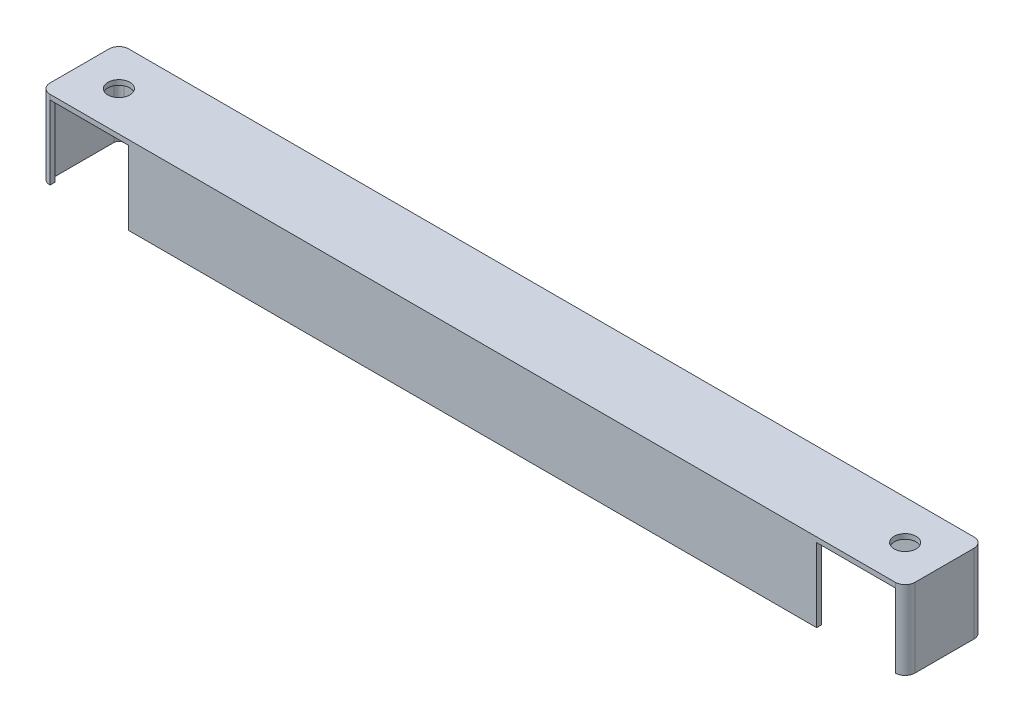
ISO-10303-21;
HEADER;
FILE_DESCRIPTION(('STEP AP214'),'2;1');
FILE_NAME('part.step','',(''),(''),'','','');
FILE_SCHEMA(('AUTOMOTIVE_DESIGN { 1 0 10303 214 1 1 1 1 }'));
ENDSEC;
DATA;
#1=APPLICATION_CONTEXT('core data for automotive mechanical design processes');
#2=APPLICATION_PROTOCOL_DEFINITION('international standard','automotive_design',2000,#1);
#3=PRODUCT_CONTEXT('',#1,'mechanical');
#4=PRODUCT('Part','Part','',(#3));
#5=PRODUCT_RELATED_PRODUCT_CATEGORY('part','',(#4));
#6=PRODUCT_DEFINITION_FORMATION('','',#4);
#7=PRODUCT_DEFINITION_CONTEXT('part definition',#1,'design');
#8=PRODUCT_DEFINITION('design','',#6,#7);
#9=PRODUCT_DEFINITION_SHAPE('','',#8);
#10=(LENGTH_UNIT() NAMED_UNIT(*) SI_UNIT(.MILLI.,.METRE.));
#11=(NAMED_UNIT(*) PLANE_ANGLE_UNIT() SI_UNIT($,.RADIAN.));
#12=(NAMED_UNIT(*) SI_UNIT($,.STERADIAN.) SOLID_ANGLE_UNIT());
#13=UNCERTAINTY_MEASURE_WITH_UNIT(LENGTH_MEASURE(1.E-05),#10,'distance_accuracy_value','');
#14=(GEOMETRIC_REPRESENTATION_CONTEXT(3) GLOBAL_UNCERTAINTY_ASSIGNED_CONTEXT((#13)) GLOBAL_UNIT_ASSIGNED_CONTEXT((#10,
#11,#12)) REPRESENTATION_CONTEXT('',''));
#15=CARTESIAN_POINT('',(0.,0.,0.));
#16=DIRECTION('',(0.,0.,1.));
#17=DIRECTION('',(1.,0.,0.));
#18=AXIS2_PLACEMENT_3D('',#15,#16,#17);
#19=CARTESIAN_POINT('',(136.525,0.,-9.525));
#20=DIRECTION('',(0.,-1.,0.));
#21=DIRECTION('',(0.,0.,-1.));
#22=AXIS2_PLACEMENT_3D('',#19,#20,#21);
#23=PLANE('',#22);
#24=DIRECTION('',(0.,0.,1.));
#25=VECTOR('',#24,1.);
#26=CARTESIAN_POINT('',(-111.125,0.,12.7));
#27=LINE('',#26,#25);
#28=CARTESIAN_POINT('',(-111.125,0.,11.1125));
#29=VERTEX_POINT('',#28);
#30=CARTESIAN_POINT('',(-111.125,0.,12.7));
#31=VERTEX_POINT('',#30);
#32=EDGE_CURVE('E338',#29,#31,#27,.T.);
#33=ORIENTED_EDGE('',*,*,#32,.F.);
#34=DIRECTION('',(-1.,0.,0.));
#35=VECTOR('',#34,1.);
#36=CARTESIAN_POINT('',(111.125,0.,11.1125));
#37=LINE('',#36,#35);
#38=CARTESIAN_POINT('',(111.125,0.,11.1125));
#39=VERTEX_POINT('',#38);
#40=EDGE_CURVE('E294',#39,#29,#37,.T.);
#41=ORIENTED_EDGE('',*,*,#40,.F.);
#42=DIRECTION('',(0.,0.,-1.));
#43=VECTOR('',#42,1.);
#44=CARTESIAN_POINT('',(111.125,0.,12.7));
#45=LINE('',#44,#43);
#46=CARTESIAN_POINT('',(111.125,0.,12.7));
#47=VERTEX_POINT('',#46);
#48=EDGE_CURVE('E299',#47,#39,#45,.T.);
#49=ORIENTED_EDGE('',*,*,#48,.F.);
#50=DIRECTION('',(1.,0.,0.));
#51=VECTOR('',#50,1.);
#52=CARTESIAN_POINT('',(-136.525,0.,12.7));
#53=LINE('',#52,#51);
#54=EDGE_CURVE('E171',#31,#47,#53,.T.);
#55=ORIENTED_EDGE('',*,*,#54,.F.);
#56=EDGE_LOOP('',(#33,#41,#49,#55));
#57=FACE_BOUND('',#56,.T.);
#58=ADVANCED_FACE('F43',(#57),#23,.T.);
#59=CARTESIAN_POINT('',(127.,25.4,0.));
#60=DIRECTION('',(0.,-1.,0.));
#61=DIRECTION('',(0.,0.,-1.));
#62=AXIS2_PLACEMENT_3D('',#59,#60,#61);
#63=CYLINDRICAL_SURFACE('',#62,3.55600000000001);
#64=CARTESIAN_POINT('',(127.,25.4,0.));
#65=DIRECTION('',(0.,1.,0.));
#66=DIRECTION('',(0.,0.,1.));
#67=AXIS2_PLACEMENT_3D('',#64,#65,#66);
#68=CIRCLE('',#67,3.55600000000001);
#69=CARTESIAN_POINT('',(127.,25.4,3.556));
#70=VERTEX_POINT('',#69);
#71=EDGE_CURVE('E158',#70,#70,#68,.T.);
#72=ORIENTED_EDGE('',*,*,#71,.T.);
#73=EDGE_LOOP('',(#72));
#74=FACE_BOUND('',#73,.T.);
#75=CARTESIAN_POINT('',(127.,23.8125,0.));
#76=DIRECTION('',(0.,-1.,0.));
#77=DIRECTION('',(0.,0.,-1.));
#78=AXIS2_PLACEMENT_3D('',#75,#76,#77);
#79=CIRCLE('',#78,3.55600000000001);
#80=CARTESIAN_POINT('',(127.,23.8125,-3.55600000000002));
#81=VERTEX_POINT('',#80);
#82=EDGE_CURVE('E234',#81,#81,#79,.T.);
#83=ORIENTED_EDGE('',*,*,#82,.T.);
#84=EDGE_LOOP('',(#83));
#85=FACE_BOUND('',#84,.T.);
#86=ADVANCED_FACE('F491',(#74,#85),#63,.F.);
#87=CARTESIAN_POINT('',(-127.,25.4,0.));
#88=DIRECTION('',(0.,-1.,0.));
#89=DIRECTION('',(0.,0.,-1.));
#90=AXIS2_PLACEMENT_3D('',#87,#88,#89);
#91=CYLINDRICAL_SURFACE('',#90,3.556);
#92=CARTESIAN_POINT('',(-127.,25.4,0.));
#93=DIRECTION('',(0.,1.,0.));
#94=DIRECTION('',(0.,0.,1.));
#95=AXIS2_PLACEMENT_3D('',#92,#93,#94);
#96=CIRCLE('',#95,3.556);
#97=CARTESIAN_POINT('',(-127.,25.4,3.55600000000001));
#98=VERTEX_POINT('',#97);
#99=EDGE_CURVE('E230',#98,#98,#96,.T.);
#100=ORIENTED_EDGE('',*,*,#99,.T.);
#101=EDGE_LOOP('',(#100));
#102=FACE_BOUND('',#101,.T.);
#103=CARTESIAN_POINT('',(-127.,23.8125,0.));
#104=DIRECTION('',(0.,-1.,0.));
#105=DIRECTION('',(0.,0.,-1.));
#106=AXIS2_PLACEMENT_3D('',#103,#104,#105);
#107=CIRCLE('',#106,3.556);
#108=CARTESIAN_POINT('',(-127.,23.8125,-3.55599999999999));
#109=VERTEX_POINT('',#108);
#110=EDGE_CURVE('E47',#109,#109,#107,.T.);
#111=ORIENTED_EDGE('',*,*,#110,.T.);
#112=EDGE_LOOP('',(#111));
#113=FACE_BOUND('',#112,.T.);
#114=ADVANCED_FACE('F495',(#102,#113),#91,.F.);
#115=CARTESIAN_POINT('',(136.525,25.4,-9.525));
#116=DIRECTION('',(0.,-1.,0.));
#117=DIRECTION('',(0.,0.,-1.));
#118=AXIS2_PLACEMENT_3D('',#115,#116,#117);
#119=PLANE('',#118);
#120=CARTESIAN_POINT('',(136.525,25.4,-9.525));
#121=DIRECTION('',(0.,1.,0.));
#122=DIRECTION('',(0.,0.,-1.));
#123=AXIS2_PLACEMENT_3D('',#120,#121,#122);
#124=CIRCLE('',#123,3.17500000000002);
#125=CARTESIAN_POINT('',(139.7,25.4,-9.525));
#126=VERTEX_POINT('',#125);
#127=CARTESIAN_POINT('',(136.525,25.4,-12.7));
#128=VERTEX_POINT('',#127);
#129=EDGE_CURVE('E178',#126,#128,#124,.T.);
#130=ORIENTED_EDGE('',*,*,#129,.T.);
#131=DIRECTION('',(-1.,0.,0.));
#132=VECTOR('',#131,1.);
#133=CARTESIAN_POINT('',(-136.525,25.4,-12.7));
#134=LINE('',#133,#132);
#135=CARTESIAN_POINT('',(-136.525,25.4,-12.7));
#136=VERTEX_POINT('',#135);
#137=EDGE_CURVE('E103',#128,#136,#134,.T.);
#138=ORIENTED_EDGE('',*,*,#137,.T.);
#139=CARTESIAN_POINT('',(-136.525,25.4,-9.525));
#140=DIRECTION('',(0.,1.,0.));
#141=DIRECTION('',(0.,0.,-1.));
#142=AXIS2_PLACEMENT_3D('',#139,#140,#141);
#143=CIRCLE('',#142,3.17500000000001);
#144=CARTESIAN_POINT('',(-139.7,25.4,-9.525));
#145=VERTEX_POINT('',#144);
#146=EDGE_CURVE('E200',#136,#145,#143,.T.);
#147=ORIENTED_EDGE('',*,*,#146,.T.);
#148=DIRECTION('',(0.,0.,1.));
#149=VECTOR('',#148,1.);
#150=CARTESIAN_POINT('',(-139.7,25.4,9.525));
#151=LINE('',#150,#149);
#152=CARTESIAN_POINT('',(-139.7,25.4,9.525));
#153=VERTEX_POINT('',#152);
#154=EDGE_CURVE('E217',#145,#153,#151,.T.);
#155=ORIENTED_EDGE('',*,*,#154,.T.);
#156=CARTESIAN_POINT('',(-136.525,25.4,9.525));
#157=DIRECTION('',(0.,1.,0.));
#158=DIRECTION('',(0.,0.,-1.));
#159=AXIS2_PLACEMENT_3D('',#156,#157,#158);
#160=CIRCLE('',#159,3.17500000000001);
#161=CARTESIAN_POINT('',(-136.525,25.4,12.7));
#162=VERTEX_POINT('',#161);
#163=EDGE_CURVE('E126',#153,#162,#160,.T.);
#164=ORIENTED_EDGE('',*,*,#163,.T.);
#165=DIRECTION('',(1.,0.,0.));
#166=VECTOR('',#165,1.);
#167=CARTESIAN_POINT('',(-136.525,25.4,12.7));
#168=LINE('',#167,#166);
#169=CARTESIAN_POINT('',(136.525,25.4,12.7));
#170=VERTEX_POINT('',#169);
#171=EDGE_CURVE('E119',#162,#170,#168,.T.);
#172=ORIENTED_EDGE('',*,*,#171,.T.);
#173=CARTESIAN_POINT('',(136.525,25.4,9.525));
#174=DIRECTION('',(0.,1.,0.));
#175=DIRECTION('',(0.,0.,1.));
#176=AXIS2_PLACEMENT_3D('',#173,#174,#175);
#177=CIRCLE('',#176,3.17500000000002);
#178=CARTESIAN_POINT('',(139.7,25.4,9.525));
#179=VERTEX_POINT('',#178);
#180=EDGE_CURVE('E124',#170,#179,#177,.T.);
#181=ORIENTED_EDGE('',*,*,#180,.T.);
#182=DIRECTION('',(0.,0.,-1.));
#183=VECTOR('',#182,1.);
#184=CARTESIAN_POINT('',(139.7,25.4,9.525));
#185=LINE('',#184,#183);
#186=EDGE_CURVE('E62',#179,#126,#185,.T.);
#187=ORIENTED_EDGE('',*,*,#186,.T.);
#188=EDGE_LOOP('',(#130,#138,#147,#155,#164,#172,#181,#187));
#189=FACE_BOUND('',#188,.T.);
#190=ORIENTED_EDGE('',*,*,#71,.F.);
#191=EDGE_LOOP('',(#190));
#192=FACE_BOUND('',#191,.T.);
#193=ORIENTED_EDGE('',*,*,#99,.F.);
#194=EDGE_LOOP('',(#193));
#195=FACE_BOUND('',#194,.T.);
#196=ADVANCED_FACE('F121',(#189,#192,#195),#119,.F.);
#197=DIRECTION('',(0.,0.,1.));
#198=VECTOR('',#197,1.);
#199=CARTESIAN_POINT('',(136.525,0.,11.1125));
#200=LINE('',#199,#198);
#201=CARTESIAN_POINT('',(136.525,0.,11.1125));
#202=VERTEX_POINT('',#201);
#203=CARTESIAN_POINT('',(136.525,0.,12.7));
#204=VERTEX_POINT('',#203);
#205=EDGE_CURVE('E303',#202,#204,#200,.T.);
#206=ORIENTED_EDGE('',*,*,#205,.F.);
#207=CARTESIAN_POINT('',(136.525,0.,9.525));
#208=DIRECTION('',(0.,-1.,0.));
#209=DIRECTION('',(0.,0.,-1.));
#210=AXIS2_PLACEMENT_3D('',#207,#208,#209);
#211=CIRCLE('',#210,1.58750000000001);
#212=CARTESIAN_POINT('',(138.1125,0.,9.525));
#213=VERTEX_POINT('',#212);
#214=EDGE_CURVE('E306',#213,#202,#211,.T.);
#215=ORIENTED_EDGE('',*,*,#214,.F.);
#216=DIRECTION('',(0.,0.,1.));
#217=VECTOR('',#216,1.);
#218=CARTESIAN_POINT('',(138.1125,0.,-9.525));
#219=LINE('',#218,#217);
#220=CARTESIAN_POINT('',(138.1125,0.,-9.525));
#221=VERTEX_POINT('',#220);
#222=EDGE_CURVE('E310',#221,#213,#219,.T.);
#223=ORIENTED_EDGE('',*,*,#222,.F.);
#224=CARTESIAN_POINT('',(136.525,0.,-9.525));
#225=DIRECTION('',(0.,-1.,0.));
#226=DIRECTION('',(0.,0.,-1.));
#227=AXIS2_PLACEMENT_3D('',#224,#225,#226);
#228=CIRCLE('',#227,1.58750000000001);
#229=CARTESIAN_POINT('',(136.525,0.,-11.1125));
#230=VERTEX_POINT('',#229);
#231=EDGE_CURVE('E314',#230,#221,#228,.T.);
#232=ORIENTED_EDGE('',*,*,#231,.F.);
#233=DIRECTION('',(1.,0.,0.));
#234=VECTOR('',#233,1.);
#235=CARTESIAN_POINT('',(-136.525,0.,-11.1125));
#236=LINE('',#235,#234);
#237=CARTESIAN_POINT('',(-136.525,0.,-11.1125));
#238=VERTEX_POINT('',#237);
#239=EDGE_CURVE('E318',#238,#230,#236,.T.);
#240=ORIENTED_EDGE('',*,*,#239,.F.);
#241=CARTESIAN_POINT('',(-136.525,0.,-9.525));
#242=DIRECTION('',(0.,-1.,0.));
#243=DIRECTION('',(0.,0.,-1.));
#244=AXIS2_PLACEMENT_3D('',#241,#242,#243);
#245=CIRCLE('',#244,1.58750000000001);
#246=CARTESIAN_POINT('',(-138.1125,0.,-9.525));
#247=VERTEX_POINT('',#246);
#248=EDGE_CURVE('E322',#247,#238,#245,.T.);
#249=ORIENTED_EDGE('',*,*,#248,.F.);
#250=DIRECTION('',(0.,0.,-1.));
#251=VECTOR('',#250,1.);
#252=CARTESIAN_POINT('',(-138.1125,0.,9.525));
#253=LINE('',#252,#251);
#254=CARTESIAN_POINT('',(-138.1125,0.,9.525));
#255=VERTEX_POINT('',#254);
#256=EDGE_CURVE('E326',#255,#247,#253,.T.);
#257=ORIENTED_EDGE('',*,*,#256,.F.);
#258=CARTESIAN_POINT('',(-136.525,0.,9.525));
#259=DIRECTION('',(0.,-1.,0.));
#260=DIRECTION('',(0.,0.,-1.));
#261=AXIS2_PLACEMENT_3D('',#258,#259,#260);
#262=CIRCLE('',#261,1.58750000000001);
#263=CARTESIAN_POINT('',(-136.525,0.,11.1125));
#264=VERTEX_POINT('',#263);
#265=EDGE_CURVE('E330',#264,#255,#262,.T.);
#266=ORIENTED_EDGE('',*,*,#265,.F.);
#267=DIRECTION('',(0.,0.,-1.));
#268=VECTOR('',#267,1.);
#269=CARTESIAN_POINT('',(-136.525,0.,11.1125));
#270=LINE('',#269,#268);
#271=CARTESIAN_POINT('',(-136.525,0.,12.7));
#272=VERTEX_POINT('',#271);
#273=EDGE_CURVE('E334',#272,#264,#270,.T.);
#274=ORIENTED_EDGE('',*,*,#273,.F.);
#275=CARTESIAN_POINT('',(-136.525,0.,9.525));
#276=DIRECTION('',(0.,1.,0.));
#277=DIRECTION('',(0.,0.,-1.));
#278=AXIS2_PLACEMENT_3D('',#275,#276,#277);
#279=CIRCLE('',#278,3.17500000000001);
#280=CARTESIAN_POINT('',(-139.7,0.,9.525));
#281=VERTEX_POINT('',#280);
#282=EDGE_CURVE('E167',#281,#272,#279,.T.);
#283=ORIENTED_EDGE('',*,*,#282,.F.);
#284=DIRECTION('',(0.,0.,1.));
#285=VECTOR('',#284,1.);
#286=CARTESIAN_POINT('',(-139.7,0.,9.525));
#287=LINE('',#286,#285);
#288=CARTESIAN_POINT('',(-139.7,0.,-9.525));
#289=VERTEX_POINT('',#288);
#290=EDGE_CURVE('E164',#289,#281,#287,.T.);
#291=ORIENTED_EDGE('',*,*,#290,.F.);
#292=CARTESIAN_POINT('',(-136.525,0.,-9.525));
#293=DIRECTION('',(0.,1.,0.));
#294=DIRECTION('',(0.,0.,-1.));
#295=AXIS2_PLACEMENT_3D('',#292,#293,#294);
#296=CIRCLE('',#295,3.17500000000001);
#297=CARTESIAN_POINT('',(-136.525,0.,-12.7));
#298=VERTEX_POINT('',#297);
#299=EDGE_CURVE('E161',#298,#289,#296,.T.);
#300=ORIENTED_EDGE('',*,*,#299,.F.);
#301=DIRECTION('',(-1.,0.,0.));
#302=VECTOR('',#301,1.);
#303=CARTESIAN_POINT('',(-136.525,0.,-12.7));
#304=LINE('',#303,#302);
#305=CARTESIAN_POINT('',(136.525,0.,-12.7));
#306=VERTEX_POINT('',#305);
#307=EDGE_CURVE('E157',#306,#298,#304,.T.);
#308=ORIENTED_EDGE('',*,*,#307,.F.);
#309=CARTESIAN_POINT('',(136.525,0.,-9.525));
#310=DIRECTION('',(0.,1.,0.));
#311=DIRECTION('',(0.,0.,-1.));
#312=AXIS2_PLACEMENT_3D('',#309,#310,#311);
#313=CIRCLE('',#312,3.17500000000002);
#314=CARTESIAN_POINT('',(139.7,0.,-9.525));
#315=VERTEX_POINT('',#314);
#316=EDGE_CURVE('E153',#315,#306,#313,.T.);
#317=ORIENTED_EDGE('',*,*,#316,.F.);
#318=DIRECTION('',(0.,0.,-1.));
#319=VECTOR('',#318,1.);
#320=CARTESIAN_POINT('',(139.7,0.,9.525));
#321=LINE('',#320,#319);
#322=CARTESIAN_POINT('',(139.7,0.,9.525));
#323=VERTEX_POINT('',#322);
#324=EDGE_CURVE('E95',#323,#315,#321,.T.);
#325=ORIENTED_EDGE('',*,*,#324,.F.);
#326=CARTESIAN_POINT('',(136.525,0.,9.525));
#327=DIRECTION('',(0.,1.,0.));
#328=DIRECTION('',(0.,0.,1.));
#329=AXIS2_PLACEMENT_3D('',#326,#327,#328);
#330=CIRCLE('',#329,3.17500000000002);
#331=EDGE_CURVE('E89',#204,#323,#330,.T.);
#332=ORIENTED_EDGE('',*,*,#331,.F.);
#333=EDGE_LOOP('',(#206,#215,#223,#232,#240,#249,#257,#266,#274,#283,#291,#300,#308,#317,#325,#332));
#334=FACE_BOUND('',#333,.T.);
#335=ADVANCED_FACE('F204',(#334),#23,.T.);
#336=CARTESIAN_POINT('',(136.525,25.4,-9.525));
#337=DIRECTION('',(0.,-1.,0.));
#338=DIRECTION('',(0.,0.,-1.));
#339=AXIS2_PLACEMENT_3D('',#336,#337,#338);
#340=CYLINDRICAL_SURFACE('',#339,3.17500000000002);
#341=ORIENTED_EDGE('',*,*,#316,.T.);
#342=DIRECTION('',(0.,-1.,0.));
#343=VECTOR('',#342,1.);
#344=CARTESIAN_POINT('',(136.525,25.4,-12.7));
#345=LINE('',#344,#343);
#346=EDGE_CURVE('E11',#128,#306,#345,.T.);
#347=ORIENTED_EDGE('',*,*,#346,.F.);
#348=ORIENTED_EDGE('',*,*,#129,.F.);
#349=DIRECTION('',(0.,-1.,0.));
#350=VECTOR('',#349,1.);
#351=CARTESIAN_POINT('',(139.7,25.4,-9.525));
#352=LINE('',#351,#350);
#353=EDGE_CURVE('E149',#126,#315,#352,.T.);
#354=ORIENTED_EDGE('',*,*,#353,.T.);
#355=EDGE_LOOP('',(#341,#347,#348,#354));
#356=FACE_BOUND('',#355,.T.);
#357=ADVANCED_FACE('F45',(#356),#340,.T.);
#358=CARTESIAN_POINT('',(-136.525,25.4,-12.7));
#359=DIRECTION('',(0.,0.,1.));
#360=DIRECTION('',(1.,0.,0.));
#361=AXIS2_PLACEMENT_3D('',#358,#359,#360);
#362=PLANE('',#361);
#363=ORIENTED_EDGE('',*,*,#307,.T.);
#364=DIRECTION('',(0.,-1.,0.));
#365=VECTOR('',#364,1.);
#366=CARTESIAN_POINT('',(-136.525,25.4,-12.7));
#367=LINE('',#366,#365);
#368=EDGE_CURVE('E54',#136,#298,#367,.T.);
#369=ORIENTED_EDGE('',*,*,#368,.F.);
#370=ORIENTED_EDGE('',*,*,#137,.F.);
#371=ORIENTED_EDGE('',*,*,#346,.T.);
#372=EDGE_LOOP('',(#363,#369,#370,#371));
#373=FACE_BOUND('',#372,.T.);
#374=ADVANCED_FACE('F504',(#373),#362,.F.);
#375=CARTESIAN_POINT('',(-136.525,25.4,-9.525));
#376=DIRECTION('',(0.,-1.,0.));
#377=DIRECTION('',(0.,0.,-1.));
#378=AXIS2_PLACEMENT_3D('',#375,#376,#377);
#379=CYLINDRICAL_SURFACE('',#378,3.17500000000001);
#380=ORIENTED_EDGE('',*,*,#299,.T.);
#381=DIRECTION('',(0.,-1.,0.));
#382=VECTOR('',#381,1.);
#383=CARTESIAN_POINT('',(-139.7,25.4,-9.525));
#384=LINE('',#383,#382);
#385=EDGE_CURVE('E189',#145,#289,#384,.T.);
#386=ORIENTED_EDGE('',*,*,#385,.F.);
#387=ORIENTED_EDGE('',*,*,#146,.F.);
#388=ORIENTED_EDGE('',*,*,#368,.T.);
#389=EDGE_LOOP('',(#380,#386,#387,#388));
#390=FACE_BOUND('',#389,.T.);
#391=ADVANCED_FACE('F198',(#390),#379,.T.);
#392=CARTESIAN_POINT('',(-139.7,25.4,9.525));
#393=DIRECTION('',(1.,0.,0.));
#394=DIRECTION('',(0.,0.,-1.));
#395=AXIS2_PLACEMENT_3D('',#392,#393,#394);
#396=PLANE('',#395);
#397=ORIENTED_EDGE('',*,*,#290,.T.);
#398=DIRECTION('',(0.,-1.,0.));
#399=VECTOR('',#398,1.);
#400=CARTESIAN_POINT('',(-139.7,25.4,9.525));
#401=LINE('',#400,#399);
#402=EDGE_CURVE('E185',#153,#281,#401,.T.);
#403=ORIENTED_EDGE('',*,*,#402,.F.);
#404=ORIENTED_EDGE('',*,*,#154,.F.);
#405=ORIENTED_EDGE('',*,*,#385,.T.);
#406=EDGE_LOOP('',(#397,#403,#404,#405));
#407=FACE_BOUND('',#406,.T.);
#408=ADVANCED_FACE('F210',(#407),#396,.F.);
#409=CARTESIAN_POINT('',(-136.525,25.4,9.525));
#410=DIRECTION('',(0.,-1.,0.));
#411=DIRECTION('',(0.,0.,-1.));
#412=AXIS2_PLACEMENT_3D('',#409,#410,#411);
#413=CYLINDRICAL_SURFACE('',#412,3.17500000000001);
#414=ORIENTED_EDGE('',*,*,#282,.T.);
#415=DIRECTION('',(0.,-1.,0.));
#416=VECTOR('',#415,1.);
#417=CARTESIAN_POINT('',(-136.525,23.8125,12.7));
#418=LINE('',#417,#416);
#419=CARTESIAN_POINT('',(-136.525,23.8125,12.7));
#420=VERTEX_POINT('',#419);
#421=EDGE_CURVE('E242',#420,#272,#418,.T.);
#422=ORIENTED_EDGE('',*,*,#421,.F.);
#423=DIRECTION('',(0.,-1.,0.));
#424=VECTOR('',#423,1.);
#425=CARTESIAN_POINT('',(-136.525,25.4,12.7));
#426=LINE('',#425,#424);
#427=EDGE_CURVE('E142',#162,#420,#426,.T.);
#428=ORIENTED_EDGE('',*,*,#427,.F.);
#429=ORIENTED_EDGE('',*,*,#163,.F.);
#430=ORIENTED_EDGE('',*,*,#402,.T.);
#431=EDGE_LOOP('',(#414,#422,#428,#429,#430));
#432=FACE_BOUND('',#431,.T.);
#433=ADVANCED_FACE('F213',(#432),#413,.T.);
#434=CARTESIAN_POINT('',(-136.525,25.4,12.7));
#435=DIRECTION('',(0.,0.,-1.));
#436=DIRECTION('',(-1.,0.,0.));
#437=AXIS2_PLACEMENT_3D('',#434,#435,#436);
#438=PLANE('',#437);
#439=ORIENTED_EDGE('',*,*,#54,.T.);
#440=DIRECTION('',(0.,-1.,0.));
#441=VECTOR('',#440,1.);
#442=CARTESIAN_POINT('',(111.125,23.8125,12.7));
#443=LINE('',#442,#441);
#444=CARTESIAN_POINT('',(111.125,23.8125,12.7));
#445=VERTEX_POINT('',#444);
#446=EDGE_CURVE('E282',#445,#47,#443,.T.);
#447=ORIENTED_EDGE('',*,*,#446,.F.);
#448=DIRECTION('',(-1.,0.,0.));
#449=VECTOR('',#448,1.);
#450=CARTESIAN_POINT('',(136.525,23.8125,12.7));
#451=LINE('',#450,#449);
#452=CARTESIAN_POINT('',(136.525,23.8125,12.7));
#453=VERTEX_POINT('',#452);
#454=EDGE_CURVE('E140',#453,#445,#451,.T.);
#455=ORIENTED_EDGE('',*,*,#454,.F.);
#456=DIRECTION('',(0.,-1.,0.));
#457=VECTOR('',#456,1.);
#458=CARTESIAN_POINT('',(136.525,25.4,12.7));
#459=LINE('',#458,#457);
#460=EDGE_CURVE('E134',#170,#453,#459,.T.);
#461=ORIENTED_EDGE('',*,*,#460,.F.);
#462=ORIENTED_EDGE('',*,*,#171,.F.);
#463=ORIENTED_EDGE('',*,*,#427,.T.);
#464=DIRECTION('',(-1.,0.,0.));
#465=VECTOR('',#464,1.);
#466=CARTESIAN_POINT('',(-136.525,23.8125,12.7));
#467=LINE('',#466,#465);
#468=CARTESIAN_POINT('',(-111.125,23.8125,12.7));
#469=VERTEX_POINT('',#468);
#470=EDGE_CURVE('E387',#469,#420,#467,.T.);
#471=ORIENTED_EDGE('',*,*,#470,.F.);
#472=DIRECTION('',(0.,-1.,0.));
#473=VECTOR('',#472,1.);
#474=CARTESIAN_POINT('',(-111.125,23.8125,12.7));
#475=LINE('',#474,#473);
#476=EDGE_CURVE('E238',#469,#31,#475,.T.);
#477=ORIENTED_EDGE('',*,*,#476,.T.);
#478=EDGE_LOOP('',(#439,#447,#455,#461,#462,#463,#471,#477));
#479=FACE_BOUND('',#478,.T.);
#480=ADVANCED_FACE('F136',(#479),#438,.F.);
#481=CARTESIAN_POINT('',(136.525,25.4,9.525));
#482=DIRECTION('',(0.,-1.,0.));
#483=DIRECTION('',(0.,0.,-1.));
#484=AXIS2_PLACEMENT_3D('',#481,#482,#483);
#485=CYLINDRICAL_SURFACE('',#484,3.17500000000002);
#486=ORIENTED_EDGE('',*,*,#331,.T.);
#487=DIRECTION('',(0.,-1.,0.));
#488=VECTOR('',#487,1.);
#489=CARTESIAN_POINT('',(139.7,25.4,9.525));
#490=LINE('',#489,#488);
#491=EDGE_CURVE('E143',#179,#323,#490,.T.);
#492=ORIENTED_EDGE('',*,*,#491,.F.);
#493=ORIENTED_EDGE('',*,*,#180,.F.);
#494=ORIENTED_EDGE('',*,*,#460,.T.);
#495=DIRECTION('',(0.,-1.,0.));
#496=VECTOR('',#495,1.);
#497=CARTESIAN_POINT('',(136.525,23.8125,12.7));
#498=LINE('',#497,#496);
#499=EDGE_CURVE('E279',#453,#204,#498,.T.);
#500=ORIENTED_EDGE('',*,*,#499,.T.);
#501=EDGE_LOOP('',(#486,#492,#493,#494,#500));
#502=FACE_BOUND('',#501,.T.);
#503=ADVANCED_FACE('F145',(#502),#485,.T.);
#504=CARTESIAN_POINT('',(139.7,25.4,9.525));
#505=DIRECTION('',(-1.,0.,0.));
#506=DIRECTION('',(0.,0.,1.));
#507=AXIS2_PLACEMENT_3D('',#504,#505,#506);
#508=PLANE('',#507);
#509=ORIENTED_EDGE('',*,*,#324,.T.);
#510=ORIENTED_EDGE('',*,*,#353,.F.);
#511=ORIENTED_EDGE('',*,*,#186,.F.);
#512=ORIENTED_EDGE('',*,*,#491,.T.);
#513=EDGE_LOOP('',(#509,#510,#511,#512));
#514=FACE_BOUND('',#513,.T.);
#515=ADVANCED_FACE('F480',(#514),#508,.F.);
#516=CARTESIAN_POINT('',(-111.125,23.8125,12.7));
#517=DIRECTION('',(1.,0.,0.));
#518=DIRECTION('',(0.,0.,-1.));
#519=AXIS2_PLACEMENT_3D('',#516,#517,#518);
#520=PLANE('',#519);
#521=ORIENTED_EDGE('',*,*,#32,.T.);
#522=ORIENTED_EDGE('',*,*,#476,.F.);
#523=DIRECTION('',(0.,0.,1.));
#524=VECTOR('',#523,1.);
#525=CARTESIAN_POINT('',(-111.125,23.8125,12.7));
#526=LINE('',#525,#524);
#527=CARTESIAN_POINT('',(-111.125,23.8125,11.1125));
#528=VERTEX_POINT('',#527);
#529=EDGE_CURVE('E298',#528,#469,#526,.T.);
#530=ORIENTED_EDGE('',*,*,#529,.F.);
#531=DIRECTION('',(0.,-1.,0.));
#532=VECTOR('',#531,1.);
#533=CARTESIAN_POINT('',(-111.125,23.8125,11.1125));
#534=LINE('',#533,#532);
#535=EDGE_CURVE('E290',#528,#29,#534,.T.);
#536=ORIENTED_EDGE('',*,*,#535,.T.);
#537=EDGE_LOOP('',(#521,#522,#530,#536));
#538=FACE_BOUND('',#537,.T.);
#539=ADVANCED_FACE('F464',(#538),#520,.F.);
#540=CARTESIAN_POINT('',(111.125,23.8125,11.1125));
#541=DIRECTION('',(0.,0.,1.));
#542=DIRECTION('',(1.,0.,0.));
#543=AXIS2_PLACEMENT_3D('',#540,#541,#542);
#544=PLANE('',#543);
#545=ORIENTED_EDGE('',*,*,#40,.T.);
#546=ORIENTED_EDGE('',*,*,#535,.F.);
#547=DIRECTION('',(-1.,0.,0.));
#548=VECTOR('',#547,1.);
#549=CARTESIAN_POINT('',(111.125,23.8125,11.1125));
#550=LINE('',#549,#548);
#551=CARTESIAN_POINT('',(111.125,23.8125,11.1125));
#552=VERTEX_POINT('',#551);
#553=EDGE_CURVE('E243',#552,#528,#550,.T.);
#554=ORIENTED_EDGE('',*,*,#553,.F.);
#555=DIRECTION('',(0.,-1.,0.));
#556=VECTOR('',#555,1.);
#557=CARTESIAN_POINT('',(111.125,23.8125,11.1125));
#558=LINE('',#557,#556);
#559=EDGE_CURVE('E286',#552,#39,#558,.T.);
#560=ORIENTED_EDGE('',*,*,#559,.T.);
#561=EDGE_LOOP('',(#545,#546,#554,#560));
#562=FACE_BOUND('',#561,.T.);
#563=ADVANCED_FACE('F467',(#562),#544,.F.);
#564=CARTESIAN_POINT('',(111.125,23.8125,12.7));
#565=DIRECTION('',(-1.,0.,0.));
#566=DIRECTION('',(0.,0.,1.));
#567=AXIS2_PLACEMENT_3D('',#564,#565,#566);
#568=PLANE('',#567);
#569=ORIENTED_EDGE('',*,*,#48,.T.);
#570=ORIENTED_EDGE('',*,*,#559,.F.);
#571=DIRECTION('',(0.,0.,-1.));
#572=VECTOR('',#571,1.);
#573=CARTESIAN_POINT('',(111.125,23.8125,12.7));
#574=LINE('',#573,#572);
#575=EDGE_CURVE('E345',#445,#552,#574,.T.);
#576=ORIENTED_EDGE('',*,*,#575,.F.);
#577=ORIENTED_EDGE('',*,*,#446,.T.);
#578=EDGE_LOOP('',(#569,#570,#576,#577));
#579=FACE_BOUND('',#578,.T.);
#580=ADVANCED_FACE('F471',(#579),#568,.F.);
#581=CARTESIAN_POINT('',(136.525,23.8125,11.1125));
#582=DIRECTION('',(1.,0.,0.));
#583=DIRECTION('',(0.,0.,-1.));
#584=AXIS2_PLACEMENT_3D('',#581,#582,#583);
#585=PLANE('',#584);
#586=ORIENTED_EDGE('',*,*,#205,.T.);
#587=ORIENTED_EDGE('',*,*,#499,.F.);
#588=DIRECTION('',(0.,0.,1.));
#589=VECTOR('',#588,1.);
#590=CARTESIAN_POINT('',(136.525,23.8125,11.1125));
#591=LINE('',#590,#589);
#592=CARTESIAN_POINT('',(136.525,23.8125,11.1125));
#593=VERTEX_POINT('',#592);
#594=EDGE_CURVE('E351',#593,#453,#591,.T.);
#595=ORIENTED_EDGE('',*,*,#594,.F.);
#596=DIRECTION('',(0.,-1.,0.));
#597=VECTOR('',#596,1.);
#598=CARTESIAN_POINT('',(136.525,23.8125,11.1125));
#599=LINE('',#598,#597);
#600=EDGE_CURVE('E275',#593,#202,#599,.T.);
#601=ORIENTED_EDGE('',*,*,#600,.T.);
#602=EDGE_LOOP('',(#586,#587,#595,#601));
#603=FACE_BOUND('',#602,.T.);
#604=ADVANCED_FACE('F475',(#603),#585,.F.);
#605=CARTESIAN_POINT('',(136.525,23.8125,9.525));
#606=DIRECTION('',(0.,-1.,0.));
#607=DIRECTION('',(0.,0.,-1.));
#608=AXIS2_PLACEMENT_3D('',#605,#606,#607);
#609=CYLINDRICAL_SURFACE('',#608,1.58750000000001);
#610=ORIENTED_EDGE('',*,*,#214,.T.);
#611=ORIENTED_EDGE('',*,*,#600,.F.);
#612=CARTESIAN_POINT('',(136.525,23.8125,9.525));
#613=DIRECTION('',(0.,-1.,0.));
#614=DIRECTION('',(0.,0.,-1.));
#615=AXIS2_PLACEMENT_3D('',#612,#613,#614);
#616=CIRCLE('',#615,1.58750000000001);
#617=CARTESIAN_POINT('',(138.1125,23.8125,9.525));
#618=VERTEX_POINT('',#617);
#619=EDGE_CURVE('E355',#618,#593,#616,.T.);
#620=ORIENTED_EDGE('',*,*,#619,.F.);
#621=DIRECTION('',(0.,-1.,0.));
#622=VECTOR('',#621,1.);
#623=CARTESIAN_POINT('',(138.1125,23.8125,9.525));
#624=LINE('',#623,#622);
#625=EDGE_CURVE('E271',#618,#213,#624,.T.);
#626=ORIENTED_EDGE('',*,*,#625,.T.);
#627=EDGE_LOOP('',(#610,#611,#620,#626));
#628=FACE_BOUND('',#627,.T.);
#629=ADVANCED_FACE('F537',(#628),#609,.F.);
#630=CARTESIAN_POINT('',(138.1125,23.8125,-9.525));
#631=DIRECTION('',(1.,0.,0.));
#632=DIRECTION('',(0.,0.,-1.));
#633=AXIS2_PLACEMENT_3D('',#630,#631,#632);
#634=PLANE('',#633);
#635=ORIENTED_EDGE('',*,*,#222,.T.);
#636=ORIENTED_EDGE('',*,*,#625,.F.);
#637=DIRECTION('',(0.,0.,1.));
#638=VECTOR('',#637,1.);
#639=CARTESIAN_POINT('',(138.1125,23.8125,-9.525));
#640=LINE('',#639,#638);
#641=CARTESIAN_POINT('',(138.1125,23.8125,-9.525));
#642=VERTEX_POINT('',#641);
#643=EDGE_CURVE('E359',#642,#618,#640,.T.);
#644=ORIENTED_EDGE('',*,*,#643,.F.);
#645=DIRECTION('',(0.,-1.,0.));
#646=VECTOR('',#645,1.);
#647=CARTESIAN_POINT('',(138.1125,23.8125,-9.525));
#648=LINE('',#647,#646);
#649=EDGE_CURVE('E267',#642,#221,#648,.T.);
#650=ORIENTED_EDGE('',*,*,#649,.T.);
#651=EDGE_LOOP('',(#635,#636,#644,#650));
#652=FACE_BOUND('',#651,.T.);
#653=ADVANCED_FACE('F533',(#652),#634,.F.);
#654=CARTESIAN_POINT('',(136.525,23.8125,-9.525));
#655=DIRECTION('',(0.,-1.,0.));
#656=DIRECTION('',(0.,0.,-1.));
#657=AXIS2_PLACEMENT_3D('',#654,#655,#656);
#658=CYLINDRICAL_SURFACE('',#657,1.58750000000001);
#659=ORIENTED_EDGE('',*,*,#231,.T.);
#660=ORIENTED_EDGE('',*,*,#649,.F.);
#661=CARTESIAN_POINT('',(136.525,23.8125,-9.525));
#662=DIRECTION('',(0.,-1.,0.));
#663=DIRECTION('',(0.,0.,-1.));
#664=AXIS2_PLACEMENT_3D('',#661,#662,#663);
#665=CIRCLE('',#664,1.58750000000001);
#666=CARTESIAN_POINT('',(136.525,23.8125,-11.1125));
#667=VERTEX_POINT('',#666);
#668=EDGE_CURVE('E363',#667,#642,#665,.T.);
#669=ORIENTED_EDGE('',*,*,#668,.F.);
#670=DIRECTION('',(0.,-1.,0.));
#671=VECTOR('',#670,1.);
#672=CARTESIAN_POINT('',(136.525,23.8125,-11.1125));
#673=LINE('',#672,#671);
#674=EDGE_CURVE('E263',#667,#230,#673,.T.);
#675=ORIENTED_EDGE('',*,*,#674,.T.);
#676=EDGE_LOOP('',(#659,#660,#669,#675));
#677=FACE_BOUND('',#676,.T.);
#678=ADVANCED_FACE('F529',(#677),#658,.F.);
#679=CARTESIAN_POINT('',(-136.525,23.8125,-11.1125));
#680=DIRECTION('',(0.,0.,-1.));
#681=DIRECTION('',(-1.,0.,0.));
#682=AXIS2_PLACEMENT_3D('',#679,#680,#681);
#683=PLANE('',#682);
#684=ORIENTED_EDGE('',*,*,#239,.T.);
#685=ORIENTED_EDGE('',*,*,#674,.F.);
#686=DIRECTION('',(1.,0.,0.));
#687=VECTOR('',#686,1.);
#688=CARTESIAN_POINT('',(-136.525,23.8125,-11.1125));
#689=LINE('',#688,#687);
#690=CARTESIAN_POINT('',(-136.525,23.8125,-11.1125));
#691=VERTEX_POINT('',#690);
#692=EDGE_CURVE('E367',#691,#667,#689,.T.);
#693=ORIENTED_EDGE('',*,*,#692,.F.);
#694=DIRECTION('',(0.,-1.,0.));
#695=VECTOR('',#694,1.);
#696=CARTESIAN_POINT('',(-136.525,23.8125,-11.1125));
#697=LINE('',#696,#695);
#698=EDGE_CURVE('E259',#691,#238,#697,.T.);
#699=ORIENTED_EDGE('',*,*,#698,.T.);
#700=EDGE_LOOP('',(#684,#685,#693,#699));
#701=FACE_BOUND('',#700,.T.);
#702=ADVANCED_FACE('F525',(#701),#683,.F.);
#703=CARTESIAN_POINT('',(-136.525,23.8125,-9.525));
#704=DIRECTION('',(0.,-1.,0.));
#705=DIRECTION('',(0.,0.,-1.));
#706=AXIS2_PLACEMENT_3D('',#703,#704,#705);
#707=CYLINDRICAL_SURFACE('',#706,1.58750000000001);
#708=ORIENTED_EDGE('',*,*,#248,.T.);
#709=ORIENTED_EDGE('',*,*,#698,.F.);
#710=CARTESIAN_POINT('',(-136.525,23.8125,-9.525));
#711=DIRECTION('',(0.,-1.,0.));
#712=DIRECTION('',(0.,0.,-1.));
#713=AXIS2_PLACEMENT_3D('',#710,#711,#712);
#714=CIRCLE('',#713,1.58750000000001);
#715=CARTESIAN_POINT('',(-138.1125,23.8125,-9.525));
#716=VERTEX_POINT('',#715);
#717=EDGE_CURVE('E371',#716,#691,#714,.T.);
#718=ORIENTED_EDGE('',*,*,#717,.F.);
#719=DIRECTION('',(0.,-1.,0.));
#720=VECTOR('',#719,1.);
#721=CARTESIAN_POINT('',(-138.1125,23.8125,-9.525));
#722=LINE('',#721,#720);
#723=EDGE_CURVE('E255',#716,#247,#722,.T.);
#724=ORIENTED_EDGE('',*,*,#723,.T.);
#725=EDGE_LOOP('',(#708,#709,#718,#724));
#726=FACE_BOUND('',#725,.T.);
#727=ADVANCED_FACE('F521',(#726),#707,.F.);
#728=CARTESIAN_POINT('',(-138.1125,23.8125,9.525));
#729=DIRECTION('',(-1.,0.,0.));
#730=DIRECTION('',(0.,0.,1.));
#731=AXIS2_PLACEMENT_3D('',#728,#729,#730);
#732=PLANE('',#731);
#733=ORIENTED_EDGE('',*,*,#256,.T.);
#734=ORIENTED_EDGE('',*,*,#723,.F.);
#735=DIRECTION('',(0.,0.,-1.));
#736=VECTOR('',#735,1.);
#737=CARTESIAN_POINT('',(-138.1125,23.8125,9.525));
#738=LINE('',#737,#736);
#739=CARTESIAN_POINT('',(-138.1125,23.8125,9.525));
#740=VERTEX_POINT('',#739);
#741=EDGE_CURVE('E375',#740,#716,#738,.T.);
#742=ORIENTED_EDGE('',*,*,#741,.F.);
#743=DIRECTION('',(0.,-1.,0.));
#744=VECTOR('',#743,1.);
#745=CARTESIAN_POINT('',(-138.1125,23.8125,9.525));
#746=LINE('',#745,#744);
#747=EDGE_CURVE('E251',#740,#255,#746,.T.);
#748=ORIENTED_EDGE('',*,*,#747,.T.);
#749=EDGE_LOOP('',(#733,#734,#742,#748));
#750=FACE_BOUND('',#749,.T.);
#751=ADVANCED_FACE('F517',(#750),#732,.F.);
#752=CARTESIAN_POINT('',(-136.525,23.8125,9.525));
#753=DIRECTION('',(0.,-1.,0.));
#754=DIRECTION('',(0.,0.,-1.));
#755=AXIS2_PLACEMENT_3D('',#752,#753,#754);
#756=CYLINDRICAL_SURFACE('',#755,1.58750000000001);
#757=ORIENTED_EDGE('',*,*,#265,.T.);
#758=ORIENTED_EDGE('',*,*,#747,.F.);
#759=CARTESIAN_POINT('',(-136.525,23.8125,9.525));
#760=DIRECTION('',(0.,-1.,0.));
#761=DIRECTION('',(0.,0.,-1.));
#762=AXIS2_PLACEMENT_3D('',#759,#760,#761);
#763=CIRCLE('',#762,1.58750000000001);
#764=CARTESIAN_POINT('',(-136.525,23.8125,11.1125));
#765=VERTEX_POINT('',#764);
#766=EDGE_CURVE('E379',#765,#740,#763,.T.);
#767=ORIENTED_EDGE('',*,*,#766,.F.);
#768=DIRECTION('',(0.,-1.,0.));
#769=VECTOR('',#768,1.);
#770=CARTESIAN_POINT('',(-136.525,23.8125,11.1125));
#771=LINE('',#770,#769);
#772=EDGE_CURVE('E247',#765,#264,#771,.T.);
#773=ORIENTED_EDGE('',*,*,#772,.T.);
#774=EDGE_LOOP('',(#757,#758,#767,#773));
#775=FACE_BOUND('',#774,.T.);
#776=ADVANCED_FACE('F514',(#775),#756,.F.);
#777=CARTESIAN_POINT('',(-136.525,23.8125,11.1125));
#778=DIRECTION('',(-1.,0.,0.));
#779=DIRECTION('',(0.,0.,1.));
#780=AXIS2_PLACEMENT_3D('',#777,#778,#779);
#781=PLANE('',#780);
#782=ORIENTED_EDGE('',*,*,#273,.T.);
#783=ORIENTED_EDGE('',*,*,#772,.F.);
#784=DIRECTION('',(0.,0.,-1.));
#785=VECTOR('',#784,1.);
#786=CARTESIAN_POINT('',(-136.525,23.8125,11.1125));
#787=LINE('',#786,#785);
#788=EDGE_CURVE('E383',#420,#765,#787,.T.);
#789=ORIENTED_EDGE('',*,*,#788,.F.);
#790=ORIENTED_EDGE('',*,*,#421,.T.);
#791=EDGE_LOOP('',(#782,#783,#789,#790));
#792=FACE_BOUND('',#791,.T.);
#793=ADVANCED_FACE('F511',(#792),#781,.F.);
#794=CARTESIAN_POINT('',(136.525,23.8125,9.525));
#795=DIRECTION('',(0.,-1.,0.));
#796=DIRECTION('',(0.,0.,-1.));
#797=AXIS2_PLACEMENT_3D('',#794,#795,#796);
#798=PLANE('',#797);
#799=ORIENTED_EDGE('',*,*,#82,.F.);
#800=EDGE_LOOP('',(#799));
#801=FACE_BOUND('',#800,.T.);
#802=ORIENTED_EDGE('',*,*,#110,.F.);
#803=EDGE_LOOP('',(#802));
#804=FACE_BOUND('',#803,.T.);
#805=ORIENTED_EDGE('',*,*,#529,.T.);
#806=ORIENTED_EDGE('',*,*,#470,.T.);
#807=ORIENTED_EDGE('',*,*,#788,.T.);
#808=ORIENTED_EDGE('',*,*,#766,.T.);
#809=ORIENTED_EDGE('',*,*,#741,.T.);
#810=ORIENTED_EDGE('',*,*,#717,.T.);
#811=ORIENTED_EDGE('',*,*,#692,.T.);
#812=ORIENTED_EDGE('',*,*,#668,.T.);
#813=ORIENTED_EDGE('',*,*,#643,.T.);
#814=ORIENTED_EDGE('',*,*,#619,.T.);
#815=ORIENTED_EDGE('',*,*,#594,.T.);
#816=ORIENTED_EDGE('',*,*,#454,.T.);
#817=ORIENTED_EDGE('',*,*,#575,.T.);
#818=ORIENTED_EDGE('',*,*,#553,.T.);
#819=EDGE_LOOP('',(#805,#806,#807,#808,#809,#810,#811,#812,#813,#814,#815,#816,#817,#818));
#820=FACE_BOUND('',#819,.T.);
#821=ADVANCED_FACE('F397',(#801,#804,#820),#798,.T.);
#822=CLOSED_SHELL('',(#58,#86,#114,#196,#335,#357,#374,#391,#408,#433,#480,#503,#515,#539,#563,
#580,#604,#629,#653,#678,#702,#727,#751,#776,#793,#821));
#823=MANIFOLD_SOLID_BREP('B2',#822);
#824=ADVANCED_BREP_SHAPE_REPRESENTATION('',(#18,#823),#14);
#825=SHAPE_DEFINITION_REPRESENTATION(#9,#824);
ENDSEC;
END-ISO-10303-21;
